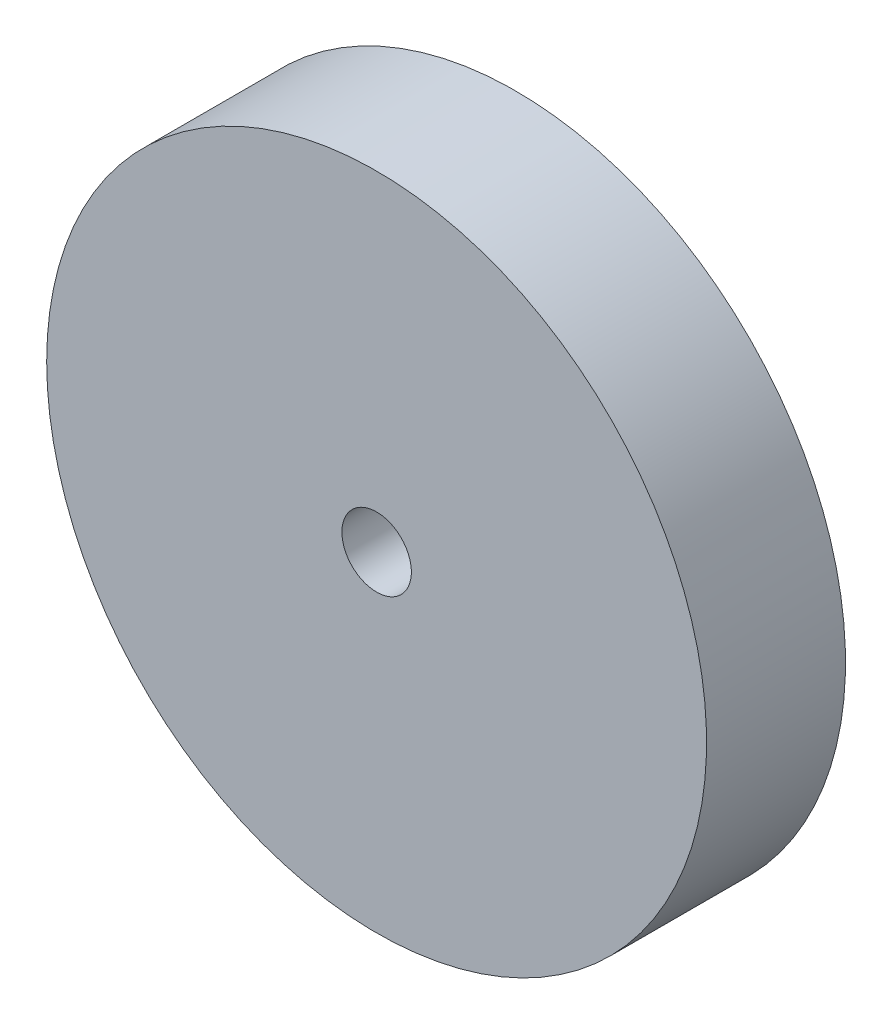
ISO-10303-21;
HEADER;
FILE_DESCRIPTION(('STEP AP214'),'2;1');
FILE_NAME('part.step','',(''),(''),'','','');
FILE_SCHEMA(('AUTOMOTIVE_DESIGN { 1 0 10303 214 1 1 1 1 }'));
ENDSEC;
DATA;
#1=APPLICATION_CONTEXT('core data for automotive mechanical design processes');
#2=APPLICATION_PROTOCOL_DEFINITION('international standard','automotive_design',2000,#1);
#3=PRODUCT_CONTEXT('',#1,'mechanical');
#4=PRODUCT('Part','Part','',(#3));
#5=PRODUCT_RELATED_PRODUCT_CATEGORY('part','',(#4));
#6=PRODUCT_DEFINITION_FORMATION('','',#4);
#7=PRODUCT_DEFINITION_CONTEXT('part definition',#1,'design');
#8=PRODUCT_DEFINITION('design','',#6,#7);
#9=PRODUCT_DEFINITION_SHAPE('','',#8);
#10=(LENGTH_UNIT() NAMED_UNIT(*) SI_UNIT(.MILLI.,.METRE.));
#11=(NAMED_UNIT(*) PLANE_ANGLE_UNIT() SI_UNIT($,.RADIAN.));
#12=(NAMED_UNIT(*) SI_UNIT($,.STERADIAN.) SOLID_ANGLE_UNIT());
#13=UNCERTAINTY_MEASURE_WITH_UNIT(LENGTH_MEASURE(1.E-05),#10,'distance_accuracy_value','');
#14=(GEOMETRIC_REPRESENTATION_CONTEXT(3) GLOBAL_UNCERTAINTY_ASSIGNED_CONTEXT((#13)) GLOBAL_UNIT_ASSIGNED_CONTEXT((#10,
#11,#12)) REPRESENTATION_CONTEXT('',''));
#15=CARTESIAN_POINT('',(0.,0.,0.));
#16=DIRECTION('',(0.,0.,1.));
#17=DIRECTION('',(1.,0.,0.));
#18=AXIS2_PLACEMENT_3D('',#15,#16,#17);
#19=CARTESIAN_POINT('',(385.621346655693,43.3255182710061,-229.556360518351));
#20=DIRECTION('',(0.,0.,1.));
#21=DIRECTION('',(1.,0.,0.));
#22=AXIS2_PLACEMENT_3D('',#19,#20,#21);
#23=PLANE('',#22);
#24=CARTESIAN_POINT('',(378.894917120642,52.8157017452683,-229.556360518351));
#25=DIRECTION('',(0.,0.,-1.));
#26=DIRECTION('',(-1.,0.,0.));
#27=AXIS2_PLACEMENT_3D('',#24,#25,#26);
#28=CIRCLE('',#27,1.);
#29=CARTESIAN_POINT('',(377.894917120642,52.8157017452683,-229.556360518351));
#30=VERTEX_POINT('',#29);
#31=EDGE_CURVE('E27',#30,#30,#28,.F.);
#32=ORIENTED_EDGE('',*,*,#31,.T.);
#33=EDGE_LOOP('',(#32));
#34=FACE_BOUND('',#33,.T.);
#35=CARTESIAN_POINT('',(378.894917120642,52.8157017452683,-229.556360518351));
#36=DIRECTION('',(0.,0.,-1.));
#37=DIRECTION('',(-1.,0.,0.));
#38=AXIS2_PLACEMENT_3D('',#35,#36,#37);
#39=CIRCLE('',#38,9.5);
#40=CARTESIAN_POINT('',(369.394917120642,52.8157017452683,-229.556360518351));
#41=VERTEX_POINT('',#40);
#42=EDGE_CURVE('E18',#41,#41,#39,.F.);
#43=ORIENTED_EDGE('',*,*,#42,.F.);
#44=EDGE_LOOP('',(#43));
#45=FACE_BOUND('',#44,.T.);
#46=ADVANCED_FACE('F15',(#34,#45),#23,.F.);
#47=CARTESIAN_POINT('',(378.894917120642,52.8157017452683,-229.556360518351));
#48=DIRECTION('',(0.,0.,-1.));
#49=DIRECTION('',(-1.,0.,0.));
#50=AXIS2_PLACEMENT_3D('',#47,#48,#49);
#51=CYLINDRICAL_SURFACE('',#50,9.5);
#52=CARTESIAN_POINT('',(378.894917120642,52.8157017452683,-225.556360518351));
#53=DIRECTION('',(0.,0.,-1.));
#54=DIRECTION('',(-1.,0.,0.));
#55=AXIS2_PLACEMENT_3D('',#52,#53,#54);
#56=CIRCLE('',#55,9.5);
#57=CARTESIAN_POINT('',(369.394917120642,52.8157017452683,-225.556360518351));
#58=VERTEX_POINT('',#57);
#59=EDGE_CURVE('E22',#58,#58,#56,.F.);
#60=ORIENTED_EDGE('',*,*,#59,.F.);
#61=EDGE_LOOP('',(#60));
#62=FACE_BOUND('',#61,.T.);
#63=ORIENTED_EDGE('',*,*,#42,.T.);
#64=EDGE_LOOP('',(#63));
#65=FACE_BOUND('',#64,.T.);
#66=ADVANCED_FACE('F35',(#62,#65),#51,.T.);
#67=CARTESIAN_POINT('',(378.894917120642,52.8157017452683,-229.556360518351));
#68=DIRECTION('',(0.,0.,-1.));
#69=DIRECTION('',(-1.,0.,0.));
#70=AXIS2_PLACEMENT_3D('',#67,#68,#69);
#71=CYLINDRICAL_SURFACE('',#70,1.);
#72=ORIENTED_EDGE('',*,*,#31,.F.);
#73=EDGE_LOOP('',(#72));
#74=FACE_BOUND('',#73,.T.);
#75=CARTESIAN_POINT('',(378.894917120642,52.8157017452683,-225.556360518351));
#76=DIRECTION('',(0.,0.,-1.));
#77=DIRECTION('',(-1.,0.,0.));
#78=AXIS2_PLACEMENT_3D('',#75,#76,#77);
#79=CIRCLE('',#78,1.);
#80=CARTESIAN_POINT('',(377.894917120642,52.8157017452683,-225.556360518351));
#81=VERTEX_POINT('',#80);
#82=EDGE_CURVE('E10',#81,#81,#79,.T.);
#83=ORIENTED_EDGE('',*,*,#82,.F.);
#84=EDGE_LOOP('',(#83));
#85=FACE_BOUND('',#84,.T.);
#86=ADVANCED_FACE('F42',(#74,#85),#71,.F.);
#87=CARTESIAN_POINT('',(385.621346655693,43.3255182710061,-225.556360518351));
#88=DIRECTION('',(0.,0.,1.));
#89=DIRECTION('',(1.,0.,0.));
#90=AXIS2_PLACEMENT_3D('',#87,#88,#89);
#91=PLANE('',#90);
#92=ORIENTED_EDGE('',*,*,#82,.T.);
#93=EDGE_LOOP('',(#92));
#94=FACE_BOUND('',#93,.T.);
#95=ORIENTED_EDGE('',*,*,#59,.T.);
#96=EDGE_LOOP('',(#95));
#97=FACE_BOUND('',#96,.T.);
#98=ADVANCED_FACE('F44',(#94,#97),#91,.T.);
#99=CLOSED_SHELL('',(#46,#66,#86,#98));
#100=MANIFOLD_SOLID_BREP('B1',#99);
#101=ADVANCED_BREP_SHAPE_REPRESENTATION('',(#18,#100),#14);
#102=SHAPE_DEFINITION_REPRESENTATION(#9,#101);
ENDSEC;
END-ISO-10303-21;
